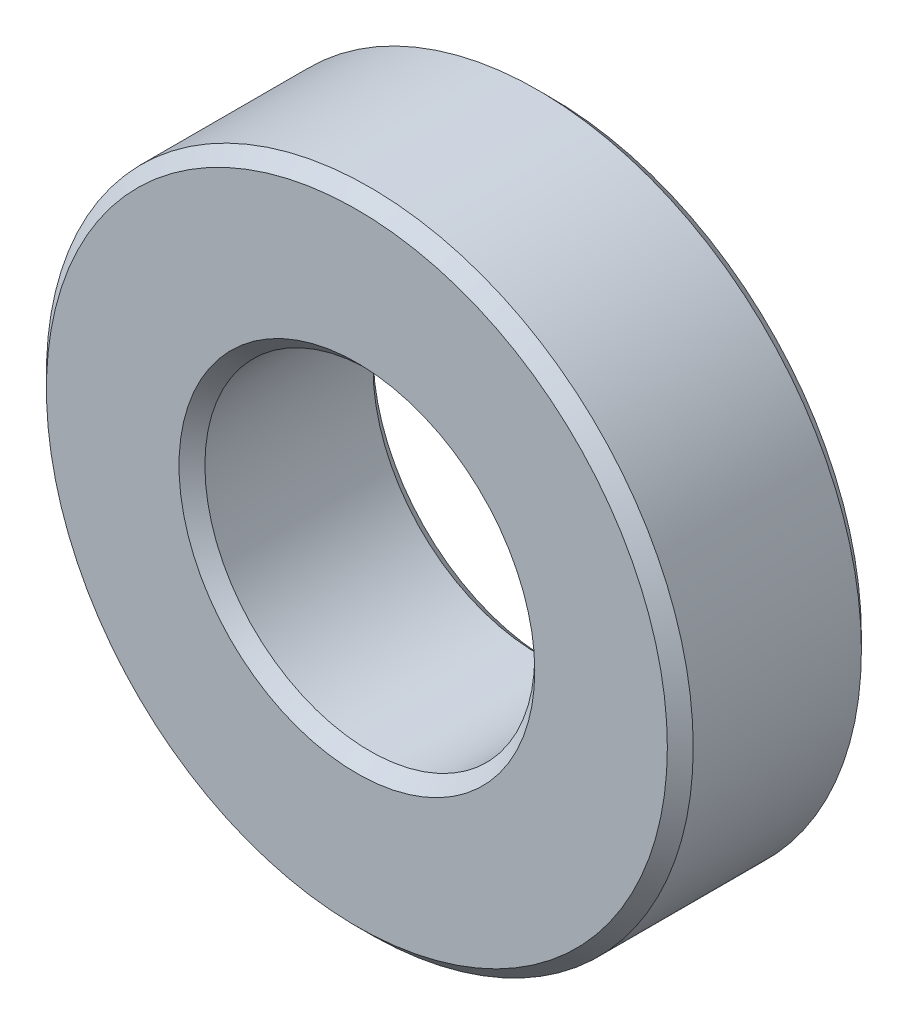
ISO-10303-21;
HEADER;
FILE_DESCRIPTION(('STEP AP214'),'2;1');
FILE_NAME('part.step','',(''),(''),'','','');
FILE_SCHEMA(('AUTOMOTIVE_DESIGN { 1 0 10303 214 1 1 1 1 }'));
ENDSEC;
DATA;
#1=APPLICATION_CONTEXT('core data for automotive mechanical design processes');
#2=APPLICATION_PROTOCOL_DEFINITION('international standard','automotive_design',2000,#1);
#3=PRODUCT_CONTEXT('',#1,'mechanical');
#4=PRODUCT('Part','Part','',(#3));
#5=PRODUCT_RELATED_PRODUCT_CATEGORY('part','',(#4));
#6=PRODUCT_DEFINITION_FORMATION('','',#4);
#7=PRODUCT_DEFINITION_CONTEXT('part definition',#1,'design');
#8=PRODUCT_DEFINITION('design','',#6,#7);
#9=PRODUCT_DEFINITION_SHAPE('','',#8);
#10=(LENGTH_UNIT() NAMED_UNIT(*) SI_UNIT(.MILLI.,.METRE.));
#11=(NAMED_UNIT(*) PLANE_ANGLE_UNIT() SI_UNIT($,.RADIAN.));
#12=(NAMED_UNIT(*) SI_UNIT($,.STERADIAN.) SOLID_ANGLE_UNIT());
#13=UNCERTAINTY_MEASURE_WITH_UNIT(LENGTH_MEASURE(1.E-05),#10,'distance_accuracy_value','');
#14=(GEOMETRIC_REPRESENTATION_CONTEXT(3) GLOBAL_UNCERTAINTY_ASSIGNED_CONTEXT((#13)) GLOBAL_UNIT_ASSIGNED_CONTEXT((#10,
#11,#12)) REPRESENTATION_CONTEXT('',''));
#15=CARTESIAN_POINT('',(0.,0.,0.));
#16=DIRECTION('',(0.,0.,1.));
#17=DIRECTION('',(1.,0.,0.));
#18=AXIS2_PLACEMENT_3D('',#15,#16,#17);
#19=CARTESIAN_POINT('',(0.,0.,3.));
#20=DIRECTION('',(0.,0.,1.));
#21=DIRECTION('',(1.,0.,0.));
#22=AXIS2_PLACEMENT_3D('',#19,#20,#21);
#23=PLANE('',#22);
#24=CARTESIAN_POINT('',(0.,0.,3.));
#25=DIRECTION('',(0.,0.,1.));
#26=DIRECTION('',(1.,0.,0.));
#27=AXIS2_PLACEMENT_3D('',#24,#25,#26);
#28=CIRCLE('',#27,2.75);
#29=CARTESIAN_POINT('',(2.75,0.,3.));
#30=VERTEX_POINT('',#29);
#31=EDGE_CURVE('E12',#30,#30,#28,.F.);
#32=ORIENTED_EDGE('',*,*,#31,.T.);
#33=EDGE_LOOP('',(#32));
#34=FACE_BOUND('',#33,.T.);
#35=CARTESIAN_POINT('',(0.,0.,3.));
#36=DIRECTION('',(0.,0.,1.));
#37=DIRECTION('',(1.,0.,0.));
#38=AXIS2_PLACEMENT_3D('',#35,#36,#37);
#39=CIRCLE('',#38,4.8);
#40=CARTESIAN_POINT('',(4.8,0.,3.));
#41=VERTEX_POINT('',#40);
#42=EDGE_CURVE('E53',#41,#41,#39,.T.);
#43=ORIENTED_EDGE('',*,*,#42,.T.);
#44=EDGE_LOOP('',(#43));
#45=FACE_BOUND('',#44,.T.);
#46=ADVANCED_FACE('F46',(#34,#45),#23,.T.);
#47=CARTESIAN_POINT('',(0.,0.,0.));
#48=DIRECTION('',(0.,0.,1.));
#49=DIRECTION('',(1.,0.,0.));
#50=AXIS2_PLACEMENT_3D('',#47,#48,#49);
#51=PLANE('',#50);
#52=CARTESIAN_POINT('',(0.,0.,0.));
#53=DIRECTION('',(0.,0.,1.));
#54=DIRECTION('',(1.,0.,0.));
#55=AXIS2_PLACEMENT_3D('',#52,#53,#54);
#56=CIRCLE('',#55,4.8);
#57=CARTESIAN_POINT('',(4.8,0.,0.));
#58=VERTEX_POINT('',#57);
#59=EDGE_CURVE('E66',#58,#58,#56,.F.);
#60=ORIENTED_EDGE('',*,*,#59,.T.);
#61=EDGE_LOOP('',(#60));
#62=FACE_BOUND('',#61,.T.);
#63=CARTESIAN_POINT('',(0.,0.,0.));
#64=DIRECTION('',(0.,0.,1.));
#65=DIRECTION('',(1.,0.,0.));
#66=AXIS2_PLACEMENT_3D('',#63,#64,#65);
#67=CIRCLE('',#66,2.75);
#68=CARTESIAN_POINT('',(2.75,0.,0.));
#69=VERTEX_POINT('',#68);
#70=EDGE_CURVE('E69',#69,#69,#67,.T.);
#71=ORIENTED_EDGE('',*,*,#70,.T.);
#72=EDGE_LOOP('',(#71));
#73=FACE_BOUND('',#72,.T.);
#74=ADVANCED_FACE('F90',(#62,#73),#51,.F.);
#75=CARTESIAN_POINT('',(0.,0.,3.));
#76=DIRECTION('',(0.,0.,-1.));
#77=DIRECTION('',(-1.,0.,0.));
#78=AXIS2_PLACEMENT_3D('',#75,#76,#77);
#79=CYLINDRICAL_SURFACE('',#78,5.);
#80=CARTESIAN_POINT('',(0.,0.,0.199999999999999));
#81=DIRECTION('',(0.,0.,1.));
#82=DIRECTION('',(1.,0.,0.));
#83=AXIS2_PLACEMENT_3D('',#80,#81,#82);
#84=CIRCLE('',#83,5.);
#85=CARTESIAN_POINT('',(5.,0.,0.199999999999999));
#86=VERTEX_POINT('',#85);
#87=EDGE_CURVE('E72',#86,#86,#84,.T.);
#88=ORIENTED_EDGE('',*,*,#87,.T.);
#89=EDGE_LOOP('',(#88));
#90=FACE_BOUND('',#89,.T.);
#91=CARTESIAN_POINT('',(0.,0.,2.8));
#92=DIRECTION('',(0.,0.,1.));
#93=DIRECTION('',(1.,0.,0.));
#94=AXIS2_PLACEMENT_3D('',#91,#92,#93);
#95=CIRCLE('',#94,5.);
#96=CARTESIAN_POINT('',(5.,0.,2.8));
#97=VERTEX_POINT('',#96);
#98=EDGE_CURVE('E75',#97,#97,#95,.F.);
#99=ORIENTED_EDGE('',*,*,#98,.T.);
#100=EDGE_LOOP('',(#99));
#101=FACE_BOUND('',#100,.T.);
#102=ADVANCED_FACE('F79',(#90,#101),#79,.T.);
#103=CARTESIAN_POINT('',(0.,0.,3.));
#104=DIRECTION('',(0.,0.,-1.));
#105=DIRECTION('',(-1.,0.,0.));
#106=AXIS2_PLACEMENT_3D('',#103,#104,#105);
#107=CYLINDRICAL_SURFACE('',#106,2.55);
#108=CARTESIAN_POINT('',(0.,0.,0.199999999999999));
#109=DIRECTION('',(0.,0.,1.));
#110=DIRECTION('',(1.,0.,0.));
#111=AXIS2_PLACEMENT_3D('',#108,#109,#110);
#112=CIRCLE('',#111,2.55);
#113=CARTESIAN_POINT('',(2.55,0.,0.199999999999999));
#114=VERTEX_POINT('',#113);
#115=EDGE_CURVE('E57',#114,#114,#112,.F.);
#116=ORIENTED_EDGE('',*,*,#115,.T.);
#117=EDGE_LOOP('',(#116));
#118=FACE_BOUND('',#117,.T.);
#119=CARTESIAN_POINT('',(0.,0.,2.8));
#120=DIRECTION('',(0.,0.,1.));
#121=DIRECTION('',(1.,0.,0.));
#122=AXIS2_PLACEMENT_3D('',#119,#120,#121);
#123=CIRCLE('',#122,2.55);
#124=CARTESIAN_POINT('',(2.55,0.,2.8));
#125=VERTEX_POINT('',#124);
#126=EDGE_CURVE('E61',#125,#125,#123,.T.);
#127=ORIENTED_EDGE('',*,*,#126,.T.);
#128=EDGE_LOOP('',(#127));
#129=FACE_BOUND('',#128,.T.);
#130=ADVANCED_FACE('F98',(#118,#129),#107,.F.);
#131=CARTESIAN_POINT('',(0.,0.,0.199999999999999));
#132=DIRECTION('',(0.,0.,1.));
#133=DIRECTION('',(1.,0.,0.));
#134=AXIS2_PLACEMENT_3D('',#131,#132,#133);
#135=CONICAL_SURFACE('',#134,5.,0.785398163397448);
#136=ORIENTED_EDGE('',*,*,#59,.F.);
#137=EDGE_LOOP('',(#136));
#138=FACE_BOUND('',#137,.T.);
#139=ORIENTED_EDGE('',*,*,#87,.F.);
#140=EDGE_LOOP('',(#139));
#141=FACE_BOUND('',#140,.T.);
#142=ADVANCED_FACE('F103',(#138,#141),#135,.T.);
#143=CARTESIAN_POINT('',(0.,0.,0.));
#144=DIRECTION('',(0.,0.,-1.));
#145=DIRECTION('',(-1.,0.,0.));
#146=AXIS2_PLACEMENT_3D('',#143,#144,#145);
#147=CONICAL_SURFACE('',#146,2.75,0.785398163397445);
#148=ORIENTED_EDGE('',*,*,#115,.F.);
#149=EDGE_LOOP('',(#148));
#150=FACE_BOUND('',#149,.T.);
#151=ORIENTED_EDGE('',*,*,#70,.F.);
#152=EDGE_LOOP('',(#151));
#153=FACE_BOUND('',#152,.T.);
#154=ADVANCED_FACE('F87',(#150,#153),#147,.F.);
#155=CARTESIAN_POINT('',(0.,0.,2.8));
#156=DIRECTION('',(0.,0.,1.));
#157=DIRECTION('',(1.,0.,0.));
#158=AXIS2_PLACEMENT_3D('',#155,#156,#157);
#159=CONICAL_SURFACE('',#158,2.55,0.785398163397449);
#160=ORIENTED_EDGE('',*,*,#31,.F.);
#161=EDGE_LOOP('',(#160));
#162=FACE_BOUND('',#161,.T.);
#163=ORIENTED_EDGE('',*,*,#126,.F.);
#164=EDGE_LOOP('',(#163));
#165=FACE_BOUND('',#164,.T.);
#166=ADVANCED_FACE('F83',(#162,#165),#159,.F.);
#167=CARTESIAN_POINT('',(0.,0.,3.));
#168=DIRECTION('',(0.,0.,-1.));
#169=DIRECTION('',(-1.,0.,0.));
#170=AXIS2_PLACEMENT_3D('',#167,#168,#169);
#171=CONICAL_SURFACE('',#170,4.8,0.785398163397446);
#172=ORIENTED_EDGE('',*,*,#98,.F.);
#173=EDGE_LOOP('',(#172));
#174=FACE_BOUND('',#173,.T.);
#175=ORIENTED_EDGE('',*,*,#42,.F.);
#176=EDGE_LOOP('',(#175));
#177=FACE_BOUND('',#176,.T.);
#178=ADVANCED_FACE('F48',(#174,#177),#171,.T.);
#179=CLOSED_SHELL('',(#46,#74,#102,#130,#142,#154,#166,#178));
#180=MANIFOLD_SOLID_BREP('B2',#179);
#181=ADVANCED_BREP_SHAPE_REPRESENTATION('',(#18,#180),#14);
#182=SHAPE_DEFINITION_REPRESENTATION(#9,#181);
ENDSEC;
END-ISO-10303-21;
